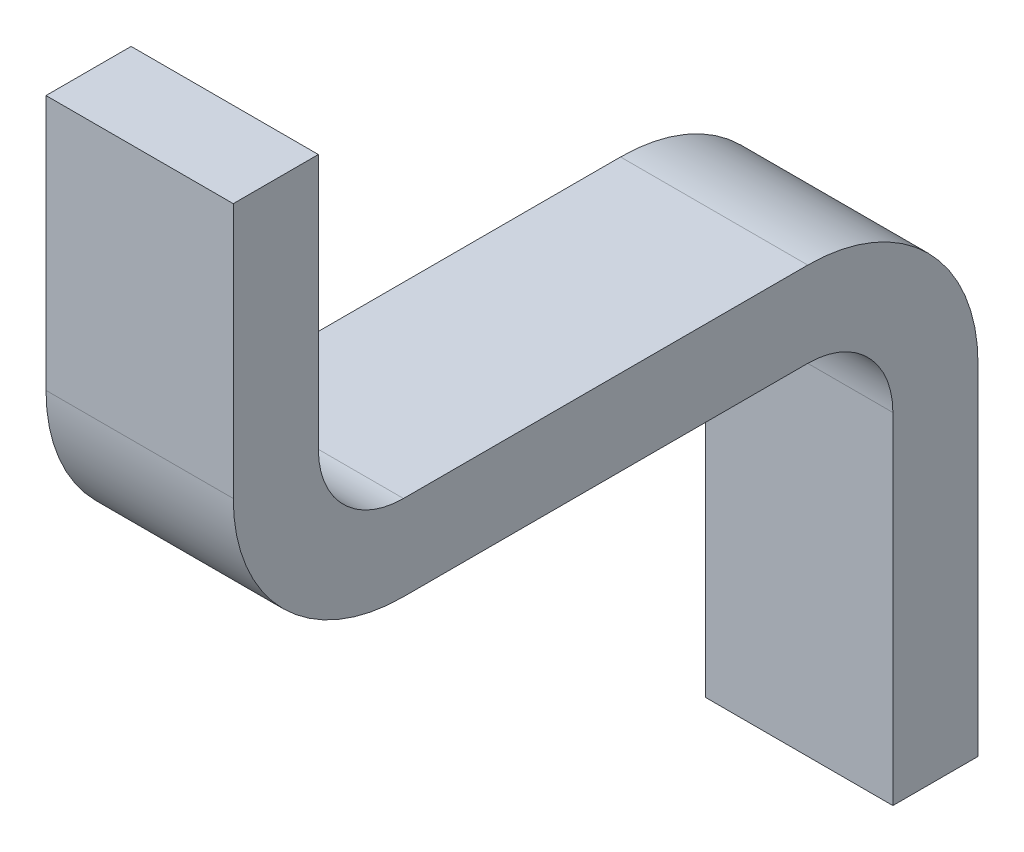
ISO-10303-21;
HEADER;
FILE_DESCRIPTION(('STEP AP214'),'2;1');
FILE_NAME('part.step','',(''),(''),'','','');
FILE_SCHEMA(('AUTOMOTIVE_DESIGN { 1 0 10303 214 1 1 1 1 }'));
ENDSEC;
DATA;
#1=APPLICATION_CONTEXT('core data for automotive mechanical design processes');
#2=APPLICATION_PROTOCOL_DEFINITION('international standard','automotive_design',2000,#1);
#3=PRODUCT_CONTEXT('',#1,'mechanical');
#4=PRODUCT('Part','Part','',(#3));
#5=PRODUCT_RELATED_PRODUCT_CATEGORY('part','',(#4));
#6=PRODUCT_DEFINITION_FORMATION('','',#4);
#7=PRODUCT_DEFINITION_CONTEXT('part definition',#1,'design');
#8=PRODUCT_DEFINITION('design','',#6,#7);
#9=PRODUCT_DEFINITION_SHAPE('','',#8);
#10=(LENGTH_UNIT() NAMED_UNIT(*) SI_UNIT(.MILLI.,.METRE.));
#11=(NAMED_UNIT(*) PLANE_ANGLE_UNIT() SI_UNIT($,.RADIAN.));
#12=(NAMED_UNIT(*) SI_UNIT($,.STERADIAN.) SOLID_ANGLE_UNIT());
#13=UNCERTAINTY_MEASURE_WITH_UNIT(LENGTH_MEASURE(1.E-05),#10,'distance_accuracy_value','');
#14=(GEOMETRIC_REPRESENTATION_CONTEXT(3) GLOBAL_UNCERTAINTY_ASSIGNED_CONTEXT((#13)) GLOBAL_UNIT_ASSIGNED_CONTEXT((#10,
#11,#12)) REPRESENTATION_CONTEXT('',''));
#15=CARTESIAN_POINT('',(0.,0.,0.));
#16=DIRECTION('',(0.,0.,1.));
#17=DIRECTION('',(1.,0.,0.));
#18=AXIS2_PLACEMENT_3D('',#15,#16,#17);
#19=CARTESIAN_POINT('',(2.64,-4.,0.675));
#20=DIRECTION('',(1.,0.,0.));
#21=DIRECTION('',(0.,1.,0.));
#22=AXIS2_PLACEMENT_3D('',#19,#20,#21);
#23=PLANE('',#22);
#24=CARTESIAN_POINT('',(2.64000000000001,-3.80000000000001,0.675));
#25=DIRECTION('',(-1.,0.,0.));
#26=DIRECTION('',(0.,-1.,0.));
#27=AXIS2_PLACEMENT_3D('',#24,#25,#26);
#28=CIRCLE('',#27,0.2);
#29=CARTESIAN_POINT('',(2.64000000000001,-3.80000000000001,0.875));
#30=VERTEX_POINT('',#29);
#31=CARTESIAN_POINT('',(2.64,-4.,0.675));
#32=VERTEX_POINT('',#31);
#33=EDGE_CURVE('E150',#30,#32,#28,.F.);
#34=ORIENTED_EDGE('',*,*,#33,.F.);
#35=DIRECTION('',(0.,1.,0.));
#36=VECTOR('',#35,1.);
#37=CARTESIAN_POINT('',(2.64,-3.5,0.875));
#38=LINE('',#37,#36);
#39=CARTESIAN_POINT('',(2.64,-3.5,0.875));
#40=VERTEX_POINT('',#39);
#41=EDGE_CURVE('E147',#30,#40,#38,.T.);
#42=ORIENTED_EDGE('',*,*,#41,.T.);
#43=DIRECTION('',(0.,0.,1.));
#44=VECTOR('',#43,1.);
#45=CARTESIAN_POINT('',(2.64,-3.5,0.775));
#46=LINE('',#45,#44);
#47=CARTESIAN_POINT('',(2.64,-3.5,0.775));
#48=VERTEX_POINT('',#47);
#49=EDGE_CURVE('E141',#48,#40,#46,.T.);
#50=ORIENTED_EDGE('',*,*,#49,.F.);
#51=DIRECTION('',(0.,1.,0.));
#52=VECTOR('',#51,1.);
#53=CARTESIAN_POINT('',(2.64,-3.5,0.775));
#54=LINE('',#53,#52);
#55=CARTESIAN_POINT('',(2.64000000000001,-3.80000000000001,0.775));
#56=VERTEX_POINT('',#55);
#57=EDGE_CURVE('E115',#48,#56,#54,.F.);
#58=ORIENTED_EDGE('',*,*,#57,.T.);
#59=CARTESIAN_POINT('',(2.64000000000001,-3.80000000000001,0.675));
#60=DIRECTION('',(-1.,0.,0.));
#61=DIRECTION('',(0.,-1.,0.));
#62=AXIS2_PLACEMENT_3D('',#59,#60,#61);
#63=CIRCLE('',#62,0.1);
#64=CARTESIAN_POINT('',(2.64,-3.9,0.675));
#65=VERTEX_POINT('',#64);
#66=EDGE_CURVE('E215',#56,#65,#63,.F.);
#67=ORIENTED_EDGE('',*,*,#66,.T.);
#68=DIRECTION('',(0.,0.,1.));
#69=VECTOR('',#68,1.);
#70=CARTESIAN_POINT('',(2.64,-3.9,0.675));
#71=LINE('',#70,#69);
#72=CARTESIAN_POINT('',(2.64,-3.9,0.2));
#73=VERTEX_POINT('',#72);
#74=EDGE_CURVE('E181',#65,#73,#71,.F.);
#75=ORIENTED_EDGE('',*,*,#74,.T.);
#76=CARTESIAN_POINT('',(2.64,-4.1,0.2));
#77=DIRECTION('',(1.,0.,0.));
#78=DIRECTION('',(0.,1.,0.));
#79=AXIS2_PLACEMENT_3D('',#76,#77,#78);
#80=CIRCLE('',#79,0.2);
#81=CARTESIAN_POINT('',(2.64,-4.1,0.));
#82=VERTEX_POINT('',#81);
#83=EDGE_CURVE('E20',#82,#73,#80,.T.);
#84=ORIENTED_EDGE('',*,*,#83,.F.);
#85=DIRECTION('',(0.,1.,0.));
#86=VECTOR('',#85,1.);
#87=CARTESIAN_POINT('',(2.64,-4.1,0.));
#88=LINE('',#87,#86);
#89=CARTESIAN_POINT('',(2.64,-4.5,0.));
#90=VERTEX_POINT('',#89);
#91=EDGE_CURVE('E91',#82,#90,#88,.F.);
#92=ORIENTED_EDGE('',*,*,#91,.T.);
#93=DIRECTION('',(0.,0.,1.));
#94=VECTOR('',#93,1.);
#95=CARTESIAN_POINT('',(2.64,-4.5,0.));
#96=LINE('',#95,#94);
#97=CARTESIAN_POINT('',(2.64,-4.5,0.1));
#98=VERTEX_POINT('',#97);
#99=EDGE_CURVE('E163',#90,#98,#96,.T.);
#100=ORIENTED_EDGE('',*,*,#99,.T.);
#101=DIRECTION('',(0.,1.,0.));
#102=VECTOR('',#101,1.);
#103=CARTESIAN_POINT('',(2.64,-4.1,0.1));
#104=LINE('',#103,#102);
#105=CARTESIAN_POINT('',(2.64,-4.1,0.1));
#106=VERTEX_POINT('',#105);
#107=EDGE_CURVE('E159',#98,#106,#104,.T.);
#108=ORIENTED_EDGE('',*,*,#107,.T.);
#109=CARTESIAN_POINT('',(2.64,-4.1,0.2));
#110=DIRECTION('',(1.,0.,0.));
#111=DIRECTION('',(0.,1.,0.));
#112=AXIS2_PLACEMENT_3D('',#109,#110,#111);
#113=CIRCLE('',#112,0.1);
#114=CARTESIAN_POINT('',(2.64,-4.,0.2));
#115=VERTEX_POINT('',#114);
#116=EDGE_CURVE('E155',#106,#115,#113,.T.);
#117=ORIENTED_EDGE('',*,*,#116,.T.);
#118=DIRECTION('',(0.,0.,1.));
#119=VECTOR('',#118,1.);
#120=CARTESIAN_POINT('',(2.64,-4.,0.675));
#121=LINE('',#120,#119);
#122=EDGE_CURVE('E154',#115,#32,#121,.T.);
#123=ORIENTED_EDGE('',*,*,#122,.T.);
#124=EDGE_LOOP('',(#34,#42,#50,#58,#67,#75,#84,#92,#100,#108,#117,#123));
#125=FACE_BOUND('',#124,.T.);
#126=ADVANCED_FACE('F17',(#125),#23,.F.);
#127=CARTESIAN_POINT('',(2.64,-4.1,0.2));
#128=DIRECTION('',(1.,0.,0.));
#129=DIRECTION('',(0.,1.,0.));
#130=AXIS2_PLACEMENT_3D('',#127,#128,#129);
#131=CYLINDRICAL_SURFACE('',#130,0.2);
#132=CARTESIAN_POINT('',(2.86,-4.1,0.2));
#133=DIRECTION('',(1.,0.,0.));
#134=DIRECTION('',(0.,1.,0.));
#135=AXIS2_PLACEMENT_3D('',#132,#133,#134);
#136=CIRCLE('',#135,0.2);
#137=CARTESIAN_POINT('',(2.86,-3.9,0.2));
#138=VERTEX_POINT('',#137);
#139=CARTESIAN_POINT('',(2.86,-4.1,0.));
#140=VERTEX_POINT('',#139);
#141=EDGE_CURVE('E183',#138,#140,#136,.F.);
#142=ORIENTED_EDGE('',*,*,#141,.T.);
#143=DIRECTION('',(1.,0.,0.));
#144=VECTOR('',#143,1.);
#145=CARTESIAN_POINT('',(2.64,-4.1,0.));
#146=LINE('',#145,#144);
#147=EDGE_CURVE('E178',#140,#82,#146,.F.);
#148=ORIENTED_EDGE('',*,*,#147,.T.);
#149=ORIENTED_EDGE('',*,*,#83,.T.);
#150=DIRECTION('',(1.,0.,0.));
#151=VECTOR('',#150,1.);
#152=CARTESIAN_POINT('',(2.64,-3.9,0.2));
#153=LINE('',#152,#151);
#154=EDGE_CURVE('E217',#73,#138,#153,.T.);
#155=ORIENTED_EDGE('',*,*,#154,.T.);
#156=EDGE_LOOP('',(#142,#148,#149,#155));
#157=FACE_BOUND('',#156,.T.);
#158=ADVANCED_FACE('F254',(#157),#131,.T.);
#159=CARTESIAN_POINT('',(2.64,-4.1,0.));
#160=DIRECTION('',(0.,0.,1.));
#161=DIRECTION('',(1.,0.,0.));
#162=AXIS2_PLACEMENT_3D('',#159,#160,#161);
#163=PLANE('',#162);
#164=ORIENTED_EDGE('',*,*,#147,.F.);
#165=DIRECTION('',(0.,-1.,0.));
#166=VECTOR('',#165,1.);
#167=CARTESIAN_POINT('',(2.86,-3.9,0.));
#168=LINE('',#167,#166);
#169=CARTESIAN_POINT('',(2.86,-4.5,0.));
#170=VERTEX_POINT('',#169);
#171=EDGE_CURVE('E170',#140,#170,#168,.T.);
#172=ORIENTED_EDGE('',*,*,#171,.T.);
#173=DIRECTION('',(-1.,0.,0.));
#174=VECTOR('',#173,1.);
#175=CARTESIAN_POINT('',(2.64,-4.5,0.));
#176=LINE('',#175,#174);
#177=EDGE_CURVE('E173',#170,#90,#176,.T.);
#178=ORIENTED_EDGE('',*,*,#177,.T.);
#179=ORIENTED_EDGE('',*,*,#91,.F.);
#180=EDGE_LOOP('',(#164,#172,#178,#179));
#181=FACE_BOUND('',#180,.T.);
#182=ADVANCED_FACE('F257',(#181),#163,.F.);
#183=CARTESIAN_POINT('',(2.64,-4.5,0.));
#184=DIRECTION('',(0.,1.,0.));
#185=DIRECTION('',(-1.,0.,0.));
#186=AXIS2_PLACEMENT_3D('',#183,#184,#185);
#187=PLANE('',#186);
#188=DIRECTION('',(-1.,0.,0.));
#189=VECTOR('',#188,1.);
#190=CARTESIAN_POINT('',(2.86,-4.5,0.1));
#191=LINE('',#190,#189);
#192=CARTESIAN_POINT('',(2.86,-4.5,0.1));
#193=VERTEX_POINT('',#192);
#194=EDGE_CURVE('E160',#193,#98,#191,.T.);
#195=ORIENTED_EDGE('',*,*,#194,.T.);
#196=ORIENTED_EDGE('',*,*,#99,.F.);
#197=ORIENTED_EDGE('',*,*,#177,.F.);
#198=DIRECTION('',(0.,0.,1.));
#199=VECTOR('',#198,1.);
#200=CARTESIAN_POINT('',(2.86,-4.5,0.675));
#201=LINE('',#200,#199);
#202=EDGE_CURVE('E166',#170,#193,#201,.T.);
#203=ORIENTED_EDGE('',*,*,#202,.T.);
#204=EDGE_LOOP('',(#195,#196,#197,#203));
#205=FACE_BOUND('',#204,.T.);
#206=ADVANCED_FACE('F259',(#205),#187,.F.);
#207=CARTESIAN_POINT('',(2.86,-4.1,0.1));
#208=DIRECTION('',(0.,0.,-1.));
#209=DIRECTION('',(-1.,0.,0.));
#210=AXIS2_PLACEMENT_3D('',#207,#208,#209);
#211=PLANE('',#210);
#212=DIRECTION('',(1.,0.,0.));
#213=VECTOR('',#212,1.);
#214=CARTESIAN_POINT('',(2.86,-4.1,0.1));
#215=LINE('',#214,#213);
#216=CARTESIAN_POINT('',(2.86,-4.1,0.1));
#217=VERTEX_POINT('',#216);
#218=EDGE_CURVE('E156',#217,#106,#215,.F.);
#219=ORIENTED_EDGE('',*,*,#218,.T.);
#220=ORIENTED_EDGE('',*,*,#107,.F.);
#221=ORIENTED_EDGE('',*,*,#194,.F.);
#222=DIRECTION('',(0.,-1.,0.));
#223=VECTOR('',#222,1.);
#224=CARTESIAN_POINT('',(2.86,-3.9,0.1));
#225=LINE('',#224,#223);
#226=EDGE_CURVE('E169',#193,#217,#225,.F.);
#227=ORIENTED_EDGE('',*,*,#226,.T.);
#228=EDGE_LOOP('',(#219,#220,#221,#227));
#229=FACE_BOUND('',#228,.T.);
#230=ADVANCED_FACE('F234',(#229),#211,.F.);
#231=CARTESIAN_POINT('',(2.86,-4.1,0.2));
#232=DIRECTION('',(1.,0.,0.));
#233=DIRECTION('',(0.,1.,0.));
#234=AXIS2_PLACEMENT_3D('',#231,#232,#233);
#235=CYLINDRICAL_SURFACE('',#234,0.1);
#236=DIRECTION('',(-1.,0.,0.));
#237=VECTOR('',#236,1.);
#238=CARTESIAN_POINT('',(2.86,-4.,0.2));
#239=LINE('',#238,#237);
#240=CARTESIAN_POINT('',(2.86,-4.,0.2));
#241=VERTEX_POINT('',#240);
#242=EDGE_CURVE('E151',#241,#115,#239,.T.);
#243=ORIENTED_EDGE('',*,*,#242,.T.);
#244=ORIENTED_EDGE('',*,*,#116,.F.);
#245=ORIENTED_EDGE('',*,*,#218,.F.);
#246=CARTESIAN_POINT('',(2.86,-4.1,0.2));
#247=DIRECTION('',(1.,0.,0.));
#248=DIRECTION('',(0.,1.,0.));
#249=AXIS2_PLACEMENT_3D('',#246,#247,#248);
#250=CIRCLE('',#249,0.1);
#251=EDGE_CURVE('E210',#217,#241,#250,.T.);
#252=ORIENTED_EDGE('',*,*,#251,.T.);
#253=EDGE_LOOP('',(#243,#244,#245,#252));
#254=FACE_BOUND('',#253,.T.);
#255=ADVANCED_FACE('F227',(#254),#235,.F.);
#256=CARTESIAN_POINT('',(2.86,-4.,0.675));
#257=DIRECTION('',(0.,1.,0.));
#258=DIRECTION('',(-1.,0.,0.));
#259=AXIS2_PLACEMENT_3D('',#256,#257,#258);
#260=PLANE('',#259);
#261=DIRECTION('',(-1.,0.,0.));
#262=VECTOR('',#261,1.);
#263=CARTESIAN_POINT('',(2.86,-4.,0.675));
#264=LINE('',#263,#262);
#265=CARTESIAN_POINT('',(2.86,-4.,0.675));
#266=VERTEX_POINT('',#265);
#267=EDGE_CURVE('E148',#32,#266,#264,.F.);
#268=ORIENTED_EDGE('',*,*,#267,.F.);
#269=ORIENTED_EDGE('',*,*,#122,.F.);
#270=ORIENTED_EDGE('',*,*,#242,.F.);
#271=DIRECTION('',(0.,0.,1.));
#272=VECTOR('',#271,1.);
#273=CARTESIAN_POINT('',(2.86,-4.,0.675));
#274=LINE('',#273,#272);
#275=EDGE_CURVE('E209',#241,#266,#274,.T.);
#276=ORIENTED_EDGE('',*,*,#275,.T.);
#277=EDGE_LOOP('',(#268,#269,#270,#276));
#278=FACE_BOUND('',#277,.T.);
#279=ADVANCED_FACE('F224',(#278),#260,.F.);
#280=CARTESIAN_POINT('',(2.86,-3.8,0.675));
#281=DIRECTION('',(-1.,0.,0.));
#282=DIRECTION('',(0.,-1.,0.));
#283=AXIS2_PLACEMENT_3D('',#280,#281,#282);
#284=CYLINDRICAL_SURFACE('',#283,0.2);
#285=ORIENTED_EDGE('',*,*,#33,.T.);
#286=ORIENTED_EDGE('',*,*,#267,.T.);
#287=CARTESIAN_POINT('',(2.86,-3.8,0.675));
#288=DIRECTION('',(-1.,0.,0.));
#289=DIRECTION('',(0.,-1.,0.));
#290=AXIS2_PLACEMENT_3D('',#287,#288,#289);
#291=CIRCLE('',#290,0.2);
#292=CARTESIAN_POINT('',(2.86,-3.8,0.875));
#293=VERTEX_POINT('',#292);
#294=EDGE_CURVE('E133',#266,#293,#291,.T.);
#295=ORIENTED_EDGE('',*,*,#294,.T.);
#296=DIRECTION('',(-1.,0.,0.));
#297=VECTOR('',#296,1.);
#298=CARTESIAN_POINT('',(2.86,-3.8,0.875));
#299=LINE('',#298,#297);
#300=EDGE_CURVE('E144',#293,#30,#299,.T.);
#301=ORIENTED_EDGE('',*,*,#300,.T.);
#302=EDGE_LOOP('',(#285,#286,#295,#301));
#303=FACE_BOUND('',#302,.T.);
#304=ADVANCED_FACE('F285',(#303),#284,.T.);
#305=CARTESIAN_POINT('',(2.86,-3.5,0.875));
#306=DIRECTION('',(0.,0.,-1.));
#307=DIRECTION('',(-1.,0.,0.));
#308=AXIS2_PLACEMENT_3D('',#305,#306,#307);
#309=PLANE('',#308);
#310=DIRECTION('',(-1.,0.,0.));
#311=VECTOR('',#310,1.);
#312=CARTESIAN_POINT('',(2.64,-3.5,0.875));
#313=LINE('',#312,#311);
#314=CARTESIAN_POINT('',(2.86,-3.5,0.875));
#315=VERTEX_POINT('',#314);
#316=EDGE_CURVE('E118',#40,#315,#313,.F.);
#317=ORIENTED_EDGE('',*,*,#316,.F.);
#318=ORIENTED_EDGE('',*,*,#41,.F.);
#319=ORIENTED_EDGE('',*,*,#300,.F.);
#320=DIRECTION('',(0.,-1.,0.));
#321=VECTOR('',#320,1.);
#322=CARTESIAN_POINT('',(2.86,-3.9,0.875));
#323=LINE('',#322,#321);
#324=EDGE_CURVE('E131',#293,#315,#323,.F.);
#325=ORIENTED_EDGE('',*,*,#324,.T.);
#326=EDGE_LOOP('',(#317,#318,#319,#325));
#327=FACE_BOUND('',#326,.T.);
#328=ADVANCED_FACE('F282',(#327),#309,.F.);
#329=CARTESIAN_POINT('',(2.64,-3.5,0.775));
#330=DIRECTION('',(0.,1.,0.));
#331=DIRECTION('',(-1.,0.,0.));
#332=AXIS2_PLACEMENT_3D('',#329,#330,#331);
#333=PLANE('',#332);
#334=ORIENTED_EDGE('',*,*,#49,.T.);
#335=ORIENTED_EDGE('',*,*,#316,.T.);
#336=DIRECTION('',(0.,0.,1.));
#337=VECTOR('',#336,1.);
#338=CARTESIAN_POINT('',(2.86,-3.5,0.675));
#339=LINE('',#338,#337);
#340=CARTESIAN_POINT('',(2.86,-3.5,0.775));
#341=VERTEX_POINT('',#340);
#342=EDGE_CURVE('E125',#315,#341,#339,.F.);
#343=ORIENTED_EDGE('',*,*,#342,.T.);
#344=DIRECTION('',(1.,0.,0.));
#345=VECTOR('',#344,1.);
#346=CARTESIAN_POINT('',(2.64,-3.5,0.775));
#347=LINE('',#346,#345);
#348=EDGE_CURVE('E110',#341,#48,#347,.F.);
#349=ORIENTED_EDGE('',*,*,#348,.T.);
#350=EDGE_LOOP('',(#334,#335,#343,#349));
#351=FACE_BOUND('',#350,.T.);
#352=ADVANCED_FACE('F129',(#351),#333,.T.);
#353=CARTESIAN_POINT('',(2.64,-3.5,0.775));
#354=DIRECTION('',(0.,0.,1.));
#355=DIRECTION('',(1.,0.,0.));
#356=AXIS2_PLACEMENT_3D('',#353,#354,#355);
#357=PLANE('',#356);
#358=ORIENTED_EDGE('',*,*,#348,.F.);
#359=DIRECTION('',(0.,-1.,0.));
#360=VECTOR('',#359,1.);
#361=CARTESIAN_POINT('',(2.86,-3.9,0.775));
#362=LINE('',#361,#360);
#363=CARTESIAN_POINT('',(2.86,-3.8,0.775));
#364=VERTEX_POINT('',#363);
#365=EDGE_CURVE('E114',#341,#364,#362,.T.);
#366=ORIENTED_EDGE('',*,*,#365,.T.);
#367=DIRECTION('',(-1.,0.,0.));
#368=VECTOR('',#367,1.);
#369=CARTESIAN_POINT('',(2.64000000000001,-3.80000000000001,0.775));
#370=LINE('',#369,#368);
#371=EDGE_CURVE('E185',#364,#56,#370,.T.);
#372=ORIENTED_EDGE('',*,*,#371,.T.);
#373=ORIENTED_EDGE('',*,*,#57,.F.);
#374=EDGE_LOOP('',(#358,#366,#372,#373));
#375=FACE_BOUND('',#374,.T.);
#376=ADVANCED_FACE('F112',(#375),#357,.F.);
#377=CARTESIAN_POINT('',(2.64000000000001,-3.80000000000001,0.675));
#378=DIRECTION('',(-1.,0.,0.));
#379=DIRECTION('',(0.,-1.,0.));
#380=AXIS2_PLACEMENT_3D('',#377,#378,#379);
#381=CYLINDRICAL_SURFACE('',#380,0.1);
#382=ORIENTED_EDGE('',*,*,#371,.F.);
#383=CARTESIAN_POINT('',(2.86,-3.8,0.675));
#384=DIRECTION('',(-1.,0.,0.));
#385=DIRECTION('',(0.,-1.,0.));
#386=AXIS2_PLACEMENT_3D('',#383,#384,#385);
#387=CIRCLE('',#386,0.1);
#388=CARTESIAN_POINT('',(2.86,-3.9,0.675));
#389=VERTEX_POINT('',#388);
#390=EDGE_CURVE('E26',#364,#389,#387,.F.);
#391=ORIENTED_EDGE('',*,*,#390,.T.);
#392=DIRECTION('',(1.,0.,0.));
#393=VECTOR('',#392,1.);
#394=CARTESIAN_POINT('',(2.64,-3.9,0.675));
#395=LINE('',#394,#393);
#396=EDGE_CURVE('E34',#389,#65,#395,.F.);
#397=ORIENTED_EDGE('',*,*,#396,.T.);
#398=ORIENTED_EDGE('',*,*,#66,.F.);
#399=EDGE_LOOP('',(#382,#391,#397,#398));
#400=FACE_BOUND('',#399,.T.);
#401=ADVANCED_FACE('F250',(#400),#381,.F.);
#402=CARTESIAN_POINT('',(2.64,-3.9,0.675));
#403=DIRECTION('',(0.,-1.,0.));
#404=DIRECTION('',(1.,0.,0.));
#405=AXIS2_PLACEMENT_3D('',#402,#403,#404);
#406=PLANE('',#405);
#407=ORIENTED_EDGE('',*,*,#396,.F.);
#408=DIRECTION('',(0.,0.,1.));
#409=VECTOR('',#408,1.);
#410=CARTESIAN_POINT('',(2.86,-3.9,0.675));
#411=LINE('',#410,#409);
#412=EDGE_CURVE('E11',#389,#138,#411,.F.);
#413=ORIENTED_EDGE('',*,*,#412,.T.);
#414=ORIENTED_EDGE('',*,*,#154,.F.);
#415=ORIENTED_EDGE('',*,*,#74,.F.);
#416=EDGE_LOOP('',(#407,#413,#414,#415));
#417=FACE_BOUND('',#416,.T.);
#418=ADVANCED_FACE('F252',(#417),#406,.F.);
#419=CARTESIAN_POINT('',(2.86,-3.9,0.675));
#420=DIRECTION('',(-1.,0.,0.));
#421=DIRECTION('',(0.,-1.,0.));
#422=AXIS2_PLACEMENT_3D('',#419,#420,#421);
#423=PLANE('',#422);
#424=ORIENTED_EDGE('',*,*,#390,.F.);
#425=ORIENTED_EDGE('',*,*,#365,.F.);
#426=ORIENTED_EDGE('',*,*,#342,.F.);
#427=ORIENTED_EDGE('',*,*,#324,.F.);
#428=ORIENTED_EDGE('',*,*,#294,.F.);
#429=ORIENTED_EDGE('',*,*,#275,.F.);
#430=ORIENTED_EDGE('',*,*,#251,.F.);
#431=ORIENTED_EDGE('',*,*,#226,.F.);
#432=ORIENTED_EDGE('',*,*,#202,.F.);
#433=ORIENTED_EDGE('',*,*,#171,.F.);
#434=ORIENTED_EDGE('',*,*,#141,.F.);
#435=ORIENTED_EDGE('',*,*,#412,.F.);
#436=EDGE_LOOP('',(#424,#425,#426,#427,#428,#429,#430,#431,#432,#433,#434,#435));
#437=FACE_BOUND('',#436,.T.);
#438=ADVANCED_FACE('F123',(#437),#423,.F.);
#439=CLOSED_SHELL('',(#126,#158,#182,#206,#230,#255,#279,#304,#328,#352,#376,#401,#418,#438));
#440=MANIFOLD_SOLID_BREP('B1',#439);
#441=ADVANCED_BREP_SHAPE_REPRESENTATION('',(#18,#440),#14);
#442=SHAPE_DEFINITION_REPRESENTATION(#9,#441);
ENDSEC;
END-ISO-10303-21;
